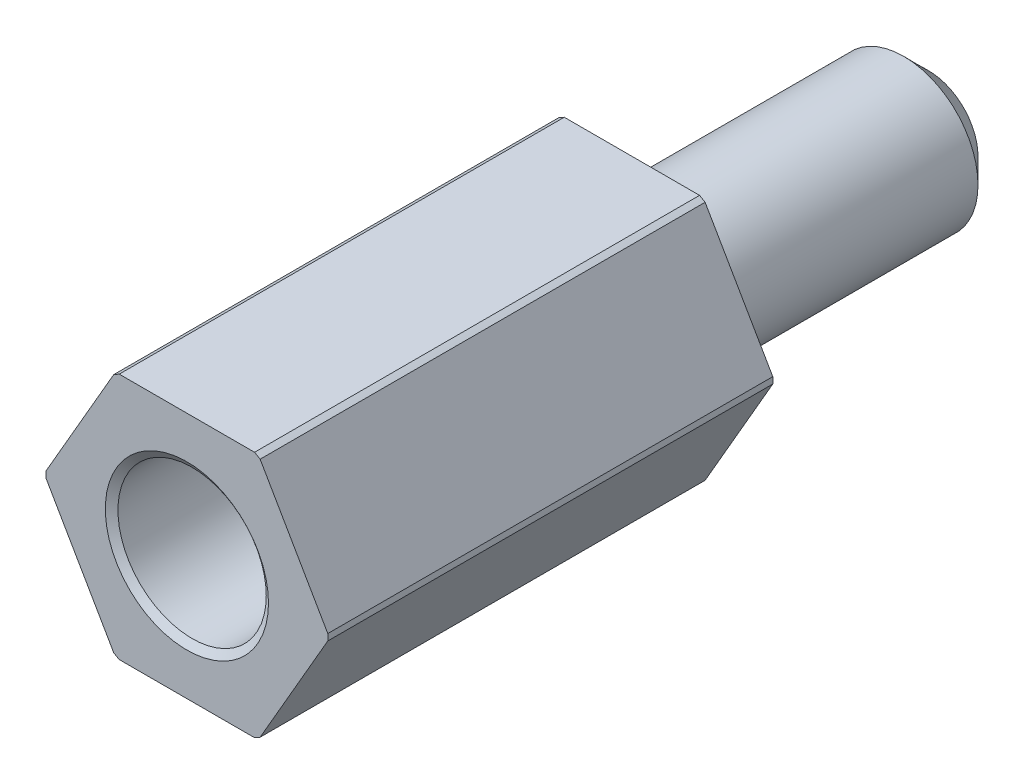
ISO-10303-21;
HEADER;
FILE_DESCRIPTION(('STEP AP214'),'2;1');
FILE_NAME('part.step','',(''),(''),'','','');
FILE_SCHEMA(('AUTOMOTIVE_DESIGN { 1 0 10303 214 1 1 1 1 }'));
ENDSEC;
DATA;
#1=APPLICATION_CONTEXT('core data for automotive mechanical design processes');
#2=APPLICATION_PROTOCOL_DEFINITION('international standard','automotive_design',2000,#1);
#3=PRODUCT_CONTEXT('',#1,'mechanical');
#4=PRODUCT('Part','Part','',(#3));
#5=PRODUCT_RELATED_PRODUCT_CATEGORY('part','',(#4));
#6=PRODUCT_DEFINITION_FORMATION('','',#4);
#7=PRODUCT_DEFINITION_CONTEXT('part definition',#1,'design');
#8=PRODUCT_DEFINITION('design','',#6,#7);
#9=PRODUCT_DEFINITION_SHAPE('','',#8);
#10=(LENGTH_UNIT() NAMED_UNIT(*) SI_UNIT(.MILLI.,.METRE.));
#11=(NAMED_UNIT(*) PLANE_ANGLE_UNIT() SI_UNIT($,.RADIAN.));
#12=(NAMED_UNIT(*) SI_UNIT($,.STERADIAN.) SOLID_ANGLE_UNIT());
#13=UNCERTAINTY_MEASURE_WITH_UNIT(LENGTH_MEASURE(1.E-05),#10,'distance_accuracy_value','');
#14=(GEOMETRIC_REPRESENTATION_CONTEXT(3) GLOBAL_UNCERTAINTY_ASSIGNED_CONTEXT((#13)) GLOBAL_UNIT_ASSIGNED_CONTEXT((#10,
#11,#12)) REPRESENTATION_CONTEXT('',''));
#15=CARTESIAN_POINT('',(0.,0.,0.));
#16=DIRECTION('',(0.,0.,1.));
#17=DIRECTION('',(1.,0.,0.));
#18=AXIS2_PLACEMENT_3D('',#15,#16,#17);
#19=CARTESIAN_POINT('',(1.44337567297406,-2.5,15.));
#20=DIRECTION('',(-0.866025403784439,0.5,0.));
#21=DIRECTION('',(-0.5,-0.866025403784439,0.));
#22=AXIS2_PLACEMENT_3D('',#19,#20,#21);
#23=PLANE('',#22);
#24=DIRECTION('',(0.,0.,-1.));
#25=VECTOR('',#24,1.);
#26=CARTESIAN_POINT('',(2.8492601186313,-0.0649367105508706,0.));
#27=LINE('',#26,#25);
#28=CARTESIAN_POINT('',(2.8492601186313,-0.0649367105508697,15.));
#29=VERTEX_POINT('',#28);
#30=CARTESIAN_POINT('',(2.8492601186313,-0.0649367105508706,6.00000000000001));
#31=VERTEX_POINT('',#30);
#32=EDGE_CURVE('E167',#29,#31,#27,.T.);
#33=ORIENTED_EDGE('',*,*,#32,.F.);
#34=DIRECTION('',(0.5,0.866025403784439,0.));
#35=VECTOR('',#34,1.);
#36=CARTESIAN_POINT('',(1.44337567297406,-2.5,15.));
#37=LINE('',#36,#35);
#38=CARTESIAN_POINT('',(1.4808669002909,-2.43506328944913,15.));
#39=VERTEX_POINT('',#38);
#40=EDGE_CURVE('E178',#39,#29,#37,.T.);
#41=ORIENTED_EDGE('',*,*,#40,.F.);
#42=DIRECTION('',(0.,0.,-1.));
#43=VECTOR('',#42,1.);
#44=CARTESIAN_POINT('',(1.4808669002909,-2.43506328944913,0.));
#45=LINE('',#44,#43);
#46=CARTESIAN_POINT('',(1.4808669002909,-2.43506328944913,6.00000000000001));
#47=VERTEX_POINT('',#46);
#48=EDGE_CURVE('E165',#47,#39,#45,.F.);
#49=ORIENTED_EDGE('',*,*,#48,.F.);
#50=DIRECTION('',(-0.5,-0.866025403784439,0.));
#51=VECTOR('',#50,1.);
#52=CARTESIAN_POINT('',(1.44337567297406,-2.5,6.00000000000001));
#53=LINE('',#52,#51);
#54=EDGE_CURVE('E176',#31,#47,#53,.T.);
#55=ORIENTED_EDGE('',*,*,#54,.F.);
#56=EDGE_LOOP('',(#33,#41,#49,#55));
#57=FACE_BOUND('',#56,.T.);
#58=ADVANCED_FACE('F30',(#57),#23,.F.);
#59=CARTESIAN_POINT('',(2.88675134594813,0.,15.));
#60=DIRECTION('',(-0.866025403784438,-0.5,0.));
#61=DIRECTION('',(0.5,-0.866025403784439,0.));
#62=AXIS2_PLACEMENT_3D('',#59,#60,#61);
#63=PLANE('',#62);
#64=DIRECTION('',(0.,0.,-1.));
#65=VECTOR('',#64,1.);
#66=CARTESIAN_POINT('',(1.48086690029089,2.43506328944913,0.));
#67=LINE('',#66,#65);
#68=CARTESIAN_POINT('',(1.48086690029089,2.43506328944913,15.));
#69=VERTEX_POINT('',#68);
#70=CARTESIAN_POINT('',(1.4808669002909,2.43506328944913,6.00000000000001));
#71=VERTEX_POINT('',#70);
#72=EDGE_CURVE('E163',#69,#71,#67,.T.);
#73=ORIENTED_EDGE('',*,*,#72,.F.);
#74=DIRECTION('',(-0.5,0.866025403784438,0.));
#75=VECTOR('',#74,1.);
#76=CARTESIAN_POINT('',(2.88675134594813,0.,15.));
#77=LINE('',#76,#75);
#78=CARTESIAN_POINT('',(2.8492601186313,0.0649367105508667,15.));
#79=VERTEX_POINT('',#78);
#80=EDGE_CURVE('E181',#79,#69,#77,.T.);
#81=ORIENTED_EDGE('',*,*,#80,.F.);
#82=DIRECTION('',(0.,0.,-1.));
#83=VECTOR('',#82,1.);
#84=CARTESIAN_POINT('',(2.8492601186313,0.0649367105508673,0.));
#85=LINE('',#84,#83);
#86=CARTESIAN_POINT('',(2.8492601186313,0.0649367105508673,6.00000000000001));
#87=VERTEX_POINT('',#86);
#88=EDGE_CURVE('E45',#87,#79,#85,.F.);
#89=ORIENTED_EDGE('',*,*,#88,.F.);
#90=DIRECTION('',(0.5,-0.866025403784439,0.));
#91=VECTOR('',#90,1.);
#92=CARTESIAN_POINT('',(2.88675134594813,0.,6.00000000000001));
#93=LINE('',#92,#91);
#94=EDGE_CURVE('E174',#71,#87,#93,.T.);
#95=ORIENTED_EDGE('',*,*,#94,.F.);
#96=EDGE_LOOP('',(#73,#81,#89,#95));
#97=FACE_BOUND('',#96,.T.);
#98=ADVANCED_FACE('F215',(#97),#63,.F.);
#99=CARTESIAN_POINT('',(1.44337567297406,2.5,15.));
#100=DIRECTION('',(0.,-1.,0.));
#101=DIRECTION('',(1.,0.,0.));
#102=AXIS2_PLACEMENT_3D('',#99,#100,#101);
#103=PLANE('',#102);
#104=DIRECTION('',(0.,0.,-1.));
#105=VECTOR('',#104,1.);
#106=CARTESIAN_POINT('',(-1.3683932183404,2.5,0.));
#107=LINE('',#106,#105);
#108=CARTESIAN_POINT('',(-1.3683932183404,2.5,15.));
#109=VERTEX_POINT('',#108);
#110=CARTESIAN_POINT('',(-1.3683932183404,2.5,6.00000000000001));
#111=VERTEX_POINT('',#110);
#112=EDGE_CURVE('E160',#109,#111,#107,.T.);
#113=ORIENTED_EDGE('',*,*,#112,.F.);
#114=DIRECTION('',(-1.,0.,0.));
#115=VECTOR('',#114,1.);
#116=CARTESIAN_POINT('',(1.44337567297406,2.5,15.));
#117=LINE('',#116,#115);
#118=CARTESIAN_POINT('',(1.3683932183404,2.5,15.));
#119=VERTEX_POINT('',#118);
#120=EDGE_CURVE('E184',#119,#109,#117,.T.);
#121=ORIENTED_EDGE('',*,*,#120,.F.);
#122=DIRECTION('',(0.,0.,-1.));
#123=VECTOR('',#122,1.);
#124=CARTESIAN_POINT('',(1.3683932183404,2.5,0.));
#125=LINE('',#124,#123);
#126=CARTESIAN_POINT('',(1.3683932183404,2.5,6.00000000000001));
#127=VERTEX_POINT('',#126);
#128=EDGE_CURVE('E158',#127,#119,#125,.F.);
#129=ORIENTED_EDGE('',*,*,#128,.F.);
#130=DIRECTION('',(1.,0.,0.));
#131=VECTOR('',#130,1.);
#132=CARTESIAN_POINT('',(1.44337567297406,2.5,6.00000000000001));
#133=LINE('',#132,#131);
#134=EDGE_CURVE('E172',#111,#127,#133,.T.);
#135=ORIENTED_EDGE('',*,*,#134,.F.);
#136=EDGE_LOOP('',(#113,#121,#129,#135));
#137=FACE_BOUND('',#136,.T.);
#138=ADVANCED_FACE('F220',(#137),#103,.F.);
#139=CARTESIAN_POINT('',(-1.44337567297407,2.5,15.));
#140=DIRECTION('',(0.866025403784439,-0.5,0.));
#141=DIRECTION('',(0.5,0.866025403784439,0.));
#142=AXIS2_PLACEMENT_3D('',#139,#140,#141);
#143=PLANE('',#142);
#144=DIRECTION('',(0.,0.,-1.));
#145=VECTOR('',#144,1.);
#146=CARTESIAN_POINT('',(-2.8492601186313,0.0649367105508693,0.));
#147=LINE('',#146,#145);
#148=CARTESIAN_POINT('',(-2.8492601186313,0.0649367105508701,15.));
#149=VERTEX_POINT('',#148);
#150=CARTESIAN_POINT('',(-2.8492601186313,0.0649367105508693,6.00000000000001));
#151=VERTEX_POINT('',#150);
#152=EDGE_CURVE('E156',#149,#151,#147,.T.);
#153=ORIENTED_EDGE('',*,*,#152,.F.);
#154=DIRECTION('',(-0.5,-0.866025403784439,0.));
#155=VECTOR('',#154,1.);
#156=CARTESIAN_POINT('',(-1.44337567297407,2.5,15.));
#157=LINE('',#156,#155);
#158=CARTESIAN_POINT('',(-1.4808669002909,2.43506328944913,15.));
#159=VERTEX_POINT('',#158);
#160=EDGE_CURVE('E187',#159,#149,#157,.T.);
#161=ORIENTED_EDGE('',*,*,#160,.F.);
#162=DIRECTION('',(0.,0.,-1.));
#163=VECTOR('',#162,1.);
#164=CARTESIAN_POINT('',(-1.4808669002909,2.43506328944913,0.));
#165=LINE('',#164,#163);
#166=CARTESIAN_POINT('',(-1.4808669002909,2.43506328944913,6.00000000000001));
#167=VERTEX_POINT('',#166);
#168=EDGE_CURVE('E154',#167,#159,#165,.F.);
#169=ORIENTED_EDGE('',*,*,#168,.F.);
#170=DIRECTION('',(0.5,0.866025403784439,0.));
#171=VECTOR('',#170,1.);
#172=CARTESIAN_POINT('',(-1.44337567297407,2.5,6.00000000000001));
#173=LINE('',#172,#171);
#174=EDGE_CURVE('E170',#151,#167,#173,.T.);
#175=ORIENTED_EDGE('',*,*,#174,.F.);
#176=EDGE_LOOP('',(#153,#161,#169,#175));
#177=FACE_BOUND('',#176,.T.);
#178=ADVANCED_FACE('F227',(#177),#143,.F.);
#179=CARTESIAN_POINT('',(-2.88675134594813,0.,15.));
#180=DIRECTION('',(0.866025403784438,0.5,0.));
#181=DIRECTION('',(-0.5,0.866025403784439,0.));
#182=AXIS2_PLACEMENT_3D('',#179,#180,#181);
#183=PLANE('',#182);
#184=DIRECTION('',(0.,0.,-1.));
#185=VECTOR('',#184,1.);
#186=CARTESIAN_POINT('',(-1.4808669002909,-2.43506328944913,0.));
#187=LINE('',#186,#185);
#188=CARTESIAN_POINT('',(-1.4808669002909,-2.43506328944913,15.));
#189=VERTEX_POINT('',#188);
#190=CARTESIAN_POINT('',(-1.4808669002909,-2.43506328944913,6.00000000000001));
#191=VERTEX_POINT('',#190);
#192=EDGE_CURVE('E152',#189,#191,#187,.T.);
#193=ORIENTED_EDGE('',*,*,#192,.F.);
#194=DIRECTION('',(0.5,-0.866025403784438,0.));
#195=VECTOR('',#194,1.);
#196=CARTESIAN_POINT('',(-2.88675134594813,0.,15.));
#197=LINE('',#196,#195);
#198=CARTESIAN_POINT('',(-2.8492601186313,-0.0649367105508688,15.));
#199=VERTEX_POINT('',#198);
#200=EDGE_CURVE('E190',#199,#189,#197,.T.);
#201=ORIENTED_EDGE('',*,*,#200,.F.);
#202=DIRECTION('',(0.,0.,-1.));
#203=VECTOR('',#202,1.);
#204=CARTESIAN_POINT('',(-2.8492601186313,-0.064936710550868,0.));
#205=LINE('',#204,#203);
#206=CARTESIAN_POINT('',(-2.8492601186313,-0.064936710550868,6.00000000000001));
#207=VERTEX_POINT('',#206);
#208=EDGE_CURVE('E150',#207,#199,#205,.F.);
#209=ORIENTED_EDGE('',*,*,#208,.F.);
#210=DIRECTION('',(-0.5,0.866025403784439,0.));
#211=VECTOR('',#210,1.);
#212=CARTESIAN_POINT('',(-2.88675134594813,0.,6.00000000000001));
#213=LINE('',#212,#211);
#214=EDGE_CURVE('E53',#191,#207,#213,.T.);
#215=ORIENTED_EDGE('',*,*,#214,.F.);
#216=EDGE_LOOP('',(#193,#201,#209,#215));
#217=FACE_BOUND('',#216,.T.);
#218=ADVANCED_FACE('F231',(#217),#183,.F.);
#219=CARTESIAN_POINT('',(-1.44337567297406,-2.5,15.));
#220=DIRECTION('',(0.,1.,0.));
#221=DIRECTION('',(0.,0.,1.));
#222=AXIS2_PLACEMENT_3D('',#219,#220,#221);
#223=PLANE('',#222);
#224=DIRECTION('',(0.,0.,-1.));
#225=VECTOR('',#224,1.);
#226=CARTESIAN_POINT('',(1.3683932183404,-2.5,0.));
#227=LINE('',#226,#225);
#228=CARTESIAN_POINT('',(1.3683932183404,-2.5,15.));
#229=VERTEX_POINT('',#228);
#230=CARTESIAN_POINT('',(1.3683932183404,-2.5,6.00000000000001));
#231=VERTEX_POINT('',#230);
#232=EDGE_CURVE('E148',#229,#231,#227,.T.);
#233=ORIENTED_EDGE('',*,*,#232,.F.);
#234=DIRECTION('',(1.,0.,0.));
#235=VECTOR('',#234,1.);
#236=CARTESIAN_POINT('',(-1.44337567297406,-2.5,15.));
#237=LINE('',#236,#235);
#238=CARTESIAN_POINT('',(-1.3683932183404,-2.5,15.));
#239=VERTEX_POINT('',#238);
#240=EDGE_CURVE('E193',#239,#229,#237,.T.);
#241=ORIENTED_EDGE('',*,*,#240,.F.);
#242=DIRECTION('',(0.,0.,-1.));
#243=VECTOR('',#242,1.);
#244=CARTESIAN_POINT('',(-1.3683932183404,-2.5,0.));
#245=LINE('',#244,#243);
#246=CARTESIAN_POINT('',(-1.3683932183404,-2.5,6.00000000000001));
#247=VERTEX_POINT('',#246);
#248=EDGE_CURVE('E146',#247,#239,#245,.F.);
#249=ORIENTED_EDGE('',*,*,#248,.F.);
#250=DIRECTION('',(-1.,0.,0.));
#251=VECTOR('',#250,1.);
#252=CARTESIAN_POINT('',(-1.44337567297406,-2.5,6.00000000000001));
#253=LINE('',#252,#251);
#254=EDGE_CURVE('E200',#231,#247,#253,.T.);
#255=ORIENTED_EDGE('',*,*,#254,.F.);
#256=EDGE_LOOP('',(#233,#241,#249,#255));
#257=FACE_BOUND('',#256,.T.);
#258=ADVANCED_FACE('F235',(#257),#223,.F.);
#259=CARTESIAN_POINT('',(2.88675134594813,0.,15.));
#260=DIRECTION('',(0.,0.,1.));
#261=DIRECTION('',(1.,0.,0.));
#262=AXIS2_PLACEMENT_3D('',#259,#260,#261);
#263=PLANE('',#262);
#264=CARTESIAN_POINT('',(0.,0.,15.));
#265=DIRECTION('',(0.,0.,1.));
#266=DIRECTION('',(1.,0.,0.));
#267=AXIS2_PLACEMENT_3D('',#264,#265,#266);
#268=CIRCLE('',#267,1.65);
#269=CARTESIAN_POINT('',(1.65,0.,15.));
#270=VERTEX_POINT('',#269);
#271=EDGE_CURVE('E277',#270,#270,#268,.T.);
#272=ORIENTED_EDGE('',*,*,#271,.F.);
#273=EDGE_LOOP('',(#272));
#274=FACE_BOUND('',#273,.T.);
#275=ORIENTED_EDGE('',*,*,#80,.T.);
#276=CARTESIAN_POINT('',(0.,0.,15.));
#277=DIRECTION('',(0.,0.,1.));
#278=DIRECTION('',(1.,0.,0.));
#279=AXIS2_PLACEMENT_3D('',#276,#277,#278);
#280=CIRCLE('',#279,2.85);
#281=EDGE_CURVE('E199',#69,#119,#280,.T.);
#282=ORIENTED_EDGE('',*,*,#281,.T.);
#283=ORIENTED_EDGE('',*,*,#120,.T.);
#284=EDGE_CURVE('E319',#109,#159,#280,.T.);
#285=ORIENTED_EDGE('',*,*,#284,.T.);
#286=ORIENTED_EDGE('',*,*,#160,.T.);
#287=EDGE_CURVE('E314',#149,#199,#280,.T.);
#288=ORIENTED_EDGE('',*,*,#287,.T.);
#289=ORIENTED_EDGE('',*,*,#200,.T.);
#290=EDGE_CURVE('E320',#189,#239,#280,.T.);
#291=ORIENTED_EDGE('',*,*,#290,.T.);
#292=ORIENTED_EDGE('',*,*,#240,.T.);
#293=EDGE_CURVE('E198',#229,#39,#280,.T.);
#294=ORIENTED_EDGE('',*,*,#293,.T.);
#295=ORIENTED_EDGE('',*,*,#40,.T.);
#296=EDGE_CURVE('E196',#29,#79,#280,.T.);
#297=ORIENTED_EDGE('',*,*,#296,.T.);
#298=EDGE_LOOP('',(#275,#282,#283,#285,#286,#288,#289,#291,#292,#294,#295,#297));
#299=FACE_BOUND('',#298,.T.);
#300=ADVANCED_FACE('F238',(#274,#299),#263,.T.);
#301=CARTESIAN_POINT('',(-14.0518129877979,0.,6.00000000000001));
#302=DIRECTION('',(0.,0.,-1.));
#303=DIRECTION('',(-1.,0.,0.));
#304=AXIS2_PLACEMENT_3D('',#301,#302,#303);
#305=PLANE('',#304);
#306=CARTESIAN_POINT('',(0.,0.,6.00000000000001));
#307=DIRECTION('',(0.,0.,-1.));
#308=DIRECTION('',(-1.,0.,0.));
#309=AXIS2_PLACEMENT_3D('',#306,#307,#308);
#310=CIRCLE('',#309,1.5);
#311=CARTESIAN_POINT('',(-1.5,0.,6.00000000000001));
#312=VERTEX_POINT('',#311);
#313=EDGE_CURVE('E132',#312,#312,#310,.T.);
#314=ORIENTED_EDGE('',*,*,#313,.F.);
#315=EDGE_LOOP('',(#314));
#316=FACE_BOUND('',#315,.T.);
#317=ORIENTED_EDGE('',*,*,#54,.T.);
#318=CARTESIAN_POINT('',(0.,0.,6.00000000000001));
#319=DIRECTION('',(0.,0.,-1.));
#320=DIRECTION('',(-1.,0.,0.));
#321=AXIS2_PLACEMENT_3D('',#318,#319,#320);
#322=CIRCLE('',#321,2.85);
#323=EDGE_CURVE('E300',#47,#231,#322,.T.);
#324=ORIENTED_EDGE('',*,*,#323,.T.);
#325=ORIENTED_EDGE('',*,*,#254,.T.);
#326=EDGE_CURVE('E144',#247,#191,#322,.T.);
#327=ORIENTED_EDGE('',*,*,#326,.T.);
#328=ORIENTED_EDGE('',*,*,#214,.T.);
#329=EDGE_CURVE('E136',#207,#151,#322,.T.);
#330=ORIENTED_EDGE('',*,*,#329,.T.);
#331=ORIENTED_EDGE('',*,*,#174,.T.);
#332=EDGE_CURVE('E145',#167,#111,#322,.T.);
#333=ORIENTED_EDGE('',*,*,#332,.T.);
#334=ORIENTED_EDGE('',*,*,#134,.T.);
#335=EDGE_CURVE('E294',#127,#71,#322,.T.);
#336=ORIENTED_EDGE('',*,*,#335,.T.);
#337=ORIENTED_EDGE('',*,*,#94,.T.);
#338=EDGE_CURVE('E299',#87,#31,#322,.T.);
#339=ORIENTED_EDGE('',*,*,#338,.T.);
#340=EDGE_LOOP('',(#317,#324,#325,#327,#328,#330,#331,#333,#334,#336,#337,#339));
#341=FACE_BOUND('',#340,.T.);
#342=ADVANCED_FACE('F243',(#316,#341),#305,.T.);
#343=CARTESIAN_POINT('',(0.,0.,0.));
#344=DIRECTION('',(0.,0.,-1.));
#345=DIRECTION('',(-1.,0.,0.));
#346=AXIS2_PLACEMENT_3D('',#343,#344,#345);
#347=CYLINDRICAL_SURFACE('',#346,2.85);
#348=ORIENTED_EDGE('',*,*,#32,.T.);
#349=ORIENTED_EDGE('',*,*,#338,.F.);
#350=ORIENTED_EDGE('',*,*,#88,.T.);
#351=ORIENTED_EDGE('',*,*,#296,.F.);
#352=EDGE_LOOP('',(#348,#349,#350,#351));
#353=FACE_BOUND('',#352,.T.);
#354=ADVANCED_FACE('F245',(#353),#347,.T.);
#355=ORIENTED_EDGE('',*,*,#48,.T.);
#356=ORIENTED_EDGE('',*,*,#293,.F.);
#357=ORIENTED_EDGE('',*,*,#232,.T.);
#358=ORIENTED_EDGE('',*,*,#323,.F.);
#359=EDGE_LOOP('',(#355,#356,#357,#358));
#360=FACE_BOUND('',#359,.T.);
#361=ADVANCED_FACE('F248',(#360),#347,.T.);
#362=ORIENTED_EDGE('',*,*,#72,.T.);
#363=ORIENTED_EDGE('',*,*,#335,.F.);
#364=ORIENTED_EDGE('',*,*,#128,.T.);
#365=ORIENTED_EDGE('',*,*,#281,.F.);
#366=EDGE_LOOP('',(#362,#363,#364,#365));
#367=FACE_BOUND('',#366,.T.);
#368=ADVANCED_FACE('F293',(#367),#347,.T.);
#369=ORIENTED_EDGE('',*,*,#112,.T.);
#370=ORIENTED_EDGE('',*,*,#332,.F.);
#371=ORIENTED_EDGE('',*,*,#168,.T.);
#372=ORIENTED_EDGE('',*,*,#284,.F.);
#373=EDGE_LOOP('',(#369,#370,#371,#372));
#374=FACE_BOUND('',#373,.T.);
#375=ADVANCED_FACE('F331',(#374),#347,.T.);
#376=ORIENTED_EDGE('',*,*,#152,.T.);
#377=ORIENTED_EDGE('',*,*,#329,.F.);
#378=ORIENTED_EDGE('',*,*,#208,.T.);
#379=ORIENTED_EDGE('',*,*,#287,.F.);
#380=EDGE_LOOP('',(#376,#377,#378,#379));
#381=FACE_BOUND('',#380,.T.);
#382=ADVANCED_FACE('F313',(#381),#347,.T.);
#383=ORIENTED_EDGE('',*,*,#192,.T.);
#384=ORIENTED_EDGE('',*,*,#326,.F.);
#385=ORIENTED_EDGE('',*,*,#248,.T.);
#386=ORIENTED_EDGE('',*,*,#290,.F.);
#387=EDGE_LOOP('',(#383,#384,#385,#386));
#388=FACE_BOUND('',#387,.T.);
#389=ADVANCED_FACE('F249',(#388),#347,.T.);
#390=CARTESIAN_POINT('',(0.,0.,0.));
#391=DIRECTION('',(0.,0.,-1.));
#392=DIRECTION('',(-1.,0.,0.));
#393=AXIS2_PLACEMENT_3D('',#390,#391,#392);
#394=CYLINDRICAL_SURFACE('',#393,1.5);
#395=CARTESIAN_POINT('',(0.,0.,0.500000000000001));
#396=DIRECTION('',(0.,0.,1.));
#397=DIRECTION('',(1.,0.,0.));
#398=AXIS2_PLACEMENT_3D('',#395,#396,#397);
#399=CIRCLE('',#398,1.5);
#400=CARTESIAN_POINT('',(1.5,0.,0.500000000000001));
#401=VERTEX_POINT('',#400);
#402=EDGE_CURVE('E11',#401,#401,#399,.T.);
#403=ORIENTED_EDGE('',*,*,#402,.T.);
#404=EDGE_LOOP('',(#403));
#405=FACE_BOUND('',#404,.T.);
#406=ORIENTED_EDGE('',*,*,#313,.T.);
#407=EDGE_LOOP('',(#406));
#408=FACE_BOUND('',#407,.T.);
#409=ADVANCED_FACE('F211',(#405,#408),#394,.T.);
#410=CARTESIAN_POINT('',(2.88675134594813,0.,0.));
#411=DIRECTION('',(0.,0.,1.));
#412=DIRECTION('',(1.,0.,0.));
#413=AXIS2_PLACEMENT_3D('',#410,#411,#412);
#414=PLANE('',#413);
#415=CARTESIAN_POINT('',(0.,0.,0.));
#416=DIRECTION('',(0.,0.,1.));
#417=DIRECTION('',(1.,0.,0.));
#418=AXIS2_PLACEMENT_3D('',#415,#416,#417);
#419=CIRCLE('',#418,0.999999999999999);
#420=CARTESIAN_POINT('',(0.999999999999999,0.,0.));
#421=VERTEX_POINT('',#420);
#422=EDGE_CURVE('E38',#421,#421,#419,.F.);
#423=ORIENTED_EDGE('',*,*,#422,.T.);
#424=EDGE_LOOP('',(#423));
#425=FACE_BOUND('',#424,.T.);
#426=ADVANCED_FACE('F204',(#425),#414,.F.);
#427=CARTESIAN_POINT('',(0.,0.,0.));
#428=DIRECTION('',(0.,0.,1.));
#429=DIRECTION('',(1.,0.,0.));
#430=AXIS2_PLACEMENT_3D('',#427,#428,#429);
#431=CONICAL_SURFACE('',#430,0.999999999999999,0.785398163397449);
#432=ORIENTED_EDGE('',*,*,#402,.F.);
#433=EDGE_LOOP('',(#432));
#434=FACE_BOUND('',#433,.T.);
#435=ORIENTED_EDGE('',*,*,#422,.F.);
#436=EDGE_LOOP('',(#435));
#437=FACE_BOUND('',#436,.T.);
#438=ADVANCED_FACE('F32',(#434,#437),#431,.T.);
#439=CARTESIAN_POINT('',(0.,0.,8.00000000000001));
#440=DIRECTION('',(0.,0.,1.));
#441=DIRECTION('',(1.,0.,0.));
#442=AXIS2_PLACEMENT_3D('',#439,#440,#441);
#443=CONICAL_SURFACE('',#442,1.25,1.02974425867665);
#444=CARTESIAN_POINT('',(0.,0.,7.24892422621556));
#445=VERTEX_POINT('',#444);
#446=VERTEX_LOOP('',#445);
#447=FACE_BOUND('',#446,.T.);
#448=CARTESIAN_POINT('',(0.,0.,8.00000000000001));
#449=DIRECTION('',(0.,0.,1.));
#450=DIRECTION('',(1.,0.,0.));
#451=AXIS2_PLACEMENT_3D('',#448,#449,#450);
#452=CIRCLE('',#451,1.25);
#453=CARTESIAN_POINT('',(1.25,0.,8.00000000000001));
#454=VERTEX_POINT('',#453);
#455=EDGE_CURVE('E130',#454,#454,#452,.T.);
#456=ORIENTED_EDGE('',*,*,#455,.T.);
#457=EDGE_LOOP('',(#456));
#458=FACE_BOUND('',#457,.T.);
#459=ADVANCED_FACE('F123',(#447,#458),#443,.F.);
#460=CARTESIAN_POINT('',(0.,0.,15.));
#461=DIRECTION('',(0.,0.,1.));
#462=DIRECTION('',(1.,0.,0.));
#463=AXIS2_PLACEMENT_3D('',#460,#461,#462);
#464=CYLINDRICAL_SURFACE('',#463,1.25);
#465=ORIENTED_EDGE('',*,*,#455,.F.);
#466=EDGE_LOOP('',(#465));
#467=FACE_BOUND('',#466,.T.);
#468=CARTESIAN_POINT('',(0.,0.,10.));
#469=DIRECTION('',(0.,0.,1.));
#470=DIRECTION('',(1.,0.,0.));
#471=AXIS2_PLACEMENT_3D('',#468,#469,#470);
#472=CIRCLE('',#471,1.25);
#473=CARTESIAN_POINT('',(1.25,0.,10.));
#474=VERTEX_POINT('',#473);
#475=EDGE_CURVE('E133',#474,#474,#472,.T.);
#476=ORIENTED_EDGE('',*,*,#475,.T.);
#477=EDGE_LOOP('',(#476));
#478=FACE_BOUND('',#477,.T.);
#479=ADVANCED_FACE('F126',(#467,#478),#464,.F.);
#480=CARTESIAN_POINT('',(1.25,0.,10.));
#481=DIRECTION('',(0.,0.,-1.));
#482=DIRECTION('',(-1.,0.,0.));
#483=AXIS2_PLACEMENT_3D('',#480,#481,#482);
#484=PLANE('',#483);
#485=ORIENTED_EDGE('',*,*,#475,.F.);
#486=EDGE_LOOP('',(#485));
#487=FACE_BOUND('',#486,.T.);
#488=CARTESIAN_POINT('',(0.,0.,10.));
#489=DIRECTION('',(0.,0.,1.));
#490=DIRECTION('',(1.,0.,0.));
#491=AXIS2_PLACEMENT_3D('',#488,#489,#490);
#492=CIRCLE('',#491,1.5);
#493=CARTESIAN_POINT('',(1.5,0.,10.));
#494=VERTEX_POINT('',#493);
#495=EDGE_CURVE('E139',#494,#494,#492,.T.);
#496=ORIENTED_EDGE('',*,*,#495,.T.);
#497=EDGE_LOOP('',(#496));
#498=FACE_BOUND('',#497,.T.);
#499=ADVANCED_FACE('F258',(#487,#498),#484,.F.);
#500=CARTESIAN_POINT('',(0.,0.,15.));
#501=DIRECTION('',(0.,0.,1.));
#502=DIRECTION('',(1.,0.,0.));
#503=AXIS2_PLACEMENT_3D('',#500,#501,#502);
#504=CYLINDRICAL_SURFACE('',#503,1.5);
#505=ORIENTED_EDGE('',*,*,#495,.F.);
#506=EDGE_LOOP('',(#505));
#507=FACE_BOUND('',#506,.T.);
#508=CARTESIAN_POINT('',(0.,0.,14.8949688692686));
#509=DIRECTION('',(0.,0.,1.));
#510=DIRECTION('',(1.,0.,0.));
#511=AXIS2_PLACEMENT_3D('',#508,#509,#510);
#512=CIRCLE('',#511,1.5);
#513=CARTESIAN_POINT('',(1.5,0.,14.8949688692686));
#514=VERTEX_POINT('',#513);
#515=EDGE_CURVE('E274',#514,#514,#512,.T.);
#516=ORIENTED_EDGE('',*,*,#515,.T.);
#517=EDGE_LOOP('',(#516));
#518=FACE_BOUND('',#517,.T.);
#519=ADVANCED_FACE('F261',(#507,#518),#504,.F.);
#520=CARTESIAN_POINT('',(0.,0.,15.));
#521=DIRECTION('',(0.,0.,1.));
#522=DIRECTION('',(1.,0.,0.));
#523=AXIS2_PLACEMENT_3D('',#520,#521,#522);
#524=CONICAL_SURFACE('',#523,1.65,0.959931088596868);
#525=ORIENTED_EDGE('',*,*,#515,.F.);
#526=EDGE_LOOP('',(#525));
#527=FACE_BOUND('',#526,.T.);
#528=ORIENTED_EDGE('',*,*,#271,.T.);
#529=EDGE_LOOP('',(#528));
#530=FACE_BOUND('',#529,.T.);
#531=ADVANCED_FACE('F265',(#527,#530),#524,.F.);
#532=CLOSED_SHELL('',(#58,#98,#138,#178,#218,#258,#300,#342,#354,#361,#368,#375,#382,#389,#409,
#426,#438,#459,#479,#499,#519,#531));
#533=MANIFOLD_SOLID_BREP('B2',#532);
#534=ADVANCED_BREP_SHAPE_REPRESENTATION('',(#18,#533),#14);
#535=SHAPE_DEFINITION_REPRESENTATION(#9,#534);
ENDSEC;
END-ISO-10303-21;
